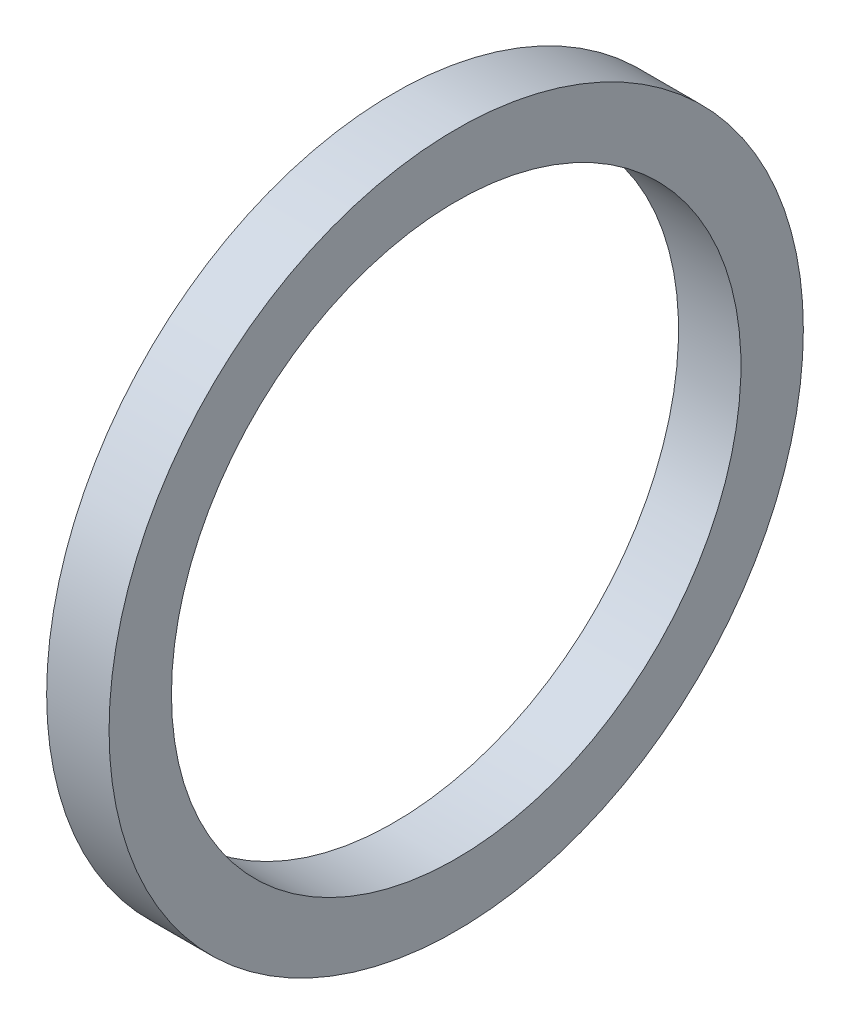
ISO-10303-21;
HEADER;
FILE_DESCRIPTION(('STEP AP214'),'2;1');
FILE_NAME('part.step','',(''),(''),'','','');
FILE_SCHEMA(('AUTOMOTIVE_DESIGN { 1 0 10303 214 1 1 1 1 }'));
ENDSEC;
DATA;
#1=APPLICATION_CONTEXT('core data for automotive mechanical design processes');
#2=APPLICATION_PROTOCOL_DEFINITION('international standard','automotive_design',2000,#1);
#3=PRODUCT_CONTEXT('',#1,'mechanical');
#4=PRODUCT('Part','Part','',(#3));
#5=PRODUCT_RELATED_PRODUCT_CATEGORY('part','',(#4));
#6=PRODUCT_DEFINITION_FORMATION('','',#4);
#7=PRODUCT_DEFINITION_CONTEXT('part definition',#1,'design');
#8=PRODUCT_DEFINITION('design','',#6,#7);
#9=PRODUCT_DEFINITION_SHAPE('','',#8);
#10=(LENGTH_UNIT() NAMED_UNIT(*) SI_UNIT(.MILLI.,.METRE.));
#11=(NAMED_UNIT(*) PLANE_ANGLE_UNIT() SI_UNIT($,.RADIAN.));
#12=(NAMED_UNIT(*) SI_UNIT($,.STERADIAN.) SOLID_ANGLE_UNIT());
#13=UNCERTAINTY_MEASURE_WITH_UNIT(LENGTH_MEASURE(1.E-05),#10,'distance_accuracy_value','');
#14=(GEOMETRIC_REPRESENTATION_CONTEXT(3) GLOBAL_UNCERTAINTY_ASSIGNED_CONTEXT((#13)) GLOBAL_UNIT_ASSIGNED_CONTEXT((#10,
#11,#12)) REPRESENTATION_CONTEXT('',''));
#15=CARTESIAN_POINT('',(0.,0.,0.));
#16=DIRECTION('',(0.,0.,1.));
#17=DIRECTION('',(1.,0.,0.));
#18=AXIS2_PLACEMENT_3D('',#15,#16,#17);
#19=CARTESIAN_POINT('',(0.,-9.271,0.));
#20=DIRECTION('',(-1.,0.,0.));
#21=DIRECTION('',(0.,0.,1.));
#22=AXIS2_PLACEMENT_3D('',#19,#20,#21);
#23=PLANE('',#22);
#24=CARTESIAN_POINT('',(0.,0.,0.));
#25=DIRECTION('',(-1.,0.,0.));
#26=DIRECTION('',(0.,0.,1.));
#27=AXIS2_PLACEMENT_3D('',#24,#25,#26);
#28=CIRCLE('',#27,11.303);
#29=CARTESIAN_POINT('',(0.,0.,11.303));
#30=VERTEX_POINT('',#29);
#31=EDGE_CURVE('E10',#30,#30,#28,.T.);
#32=ORIENTED_EDGE('',*,*,#31,.T.);
#33=EDGE_LOOP('',(#32));
#34=FACE_BOUND('',#33,.T.);
#35=CARTESIAN_POINT('',(0.,0.,0.));
#36=DIRECTION('',(-1.,0.,0.));
#37=DIRECTION('',(0.,0.,1.));
#38=AXIS2_PLACEMENT_3D('',#35,#36,#37);
#39=CIRCLE('',#38,9.271);
#40=CARTESIAN_POINT('',(0.,0.,9.271));
#41=VERTEX_POINT('',#40);
#42=EDGE_CURVE('E43',#41,#41,#39,.T.);
#43=ORIENTED_EDGE('',*,*,#42,.F.);
#44=EDGE_LOOP('',(#43));
#45=FACE_BOUND('',#44,.T.);
#46=ADVANCED_FACE('F29',(#34,#45),#23,.T.);
#47=CARTESIAN_POINT('',(-43.7165807560137,0.,0.));
#48=DIRECTION('',(-1.,0.,0.));
#49=DIRECTION('',(0.,0.,1.));
#50=AXIS2_PLACEMENT_3D('',#47,#48,#49);
#51=CYLINDRICAL_SURFACE('',#50,11.303);
#52=CARTESIAN_POINT('',(2.032,0.,0.));
#53=DIRECTION('',(-1.,0.,0.));
#54=DIRECTION('',(0.,0.,1.));
#55=AXIS2_PLACEMENT_3D('',#52,#53,#54);
#56=CIRCLE('',#55,11.303);
#57=CARTESIAN_POINT('',(2.032,0.,11.303));
#58=VERTEX_POINT('',#57);
#59=EDGE_CURVE('E35',#58,#58,#56,.T.);
#60=ORIENTED_EDGE('',*,*,#59,.T.);
#61=EDGE_LOOP('',(#60));
#62=FACE_BOUND('',#61,.T.);
#63=ORIENTED_EDGE('',*,*,#31,.F.);
#64=EDGE_LOOP('',(#63));
#65=FACE_BOUND('',#64,.T.);
#66=ADVANCED_FACE('F53',(#62,#65),#51,.T.);
#67=CARTESIAN_POINT('',(2.032,-9.271,0.));
#68=DIRECTION('',(1.,0.,0.));
#69=DIRECTION('',(0.,0.,-1.));
#70=AXIS2_PLACEMENT_3D('',#67,#68,#69);
#71=PLANE('',#70);
#72=CARTESIAN_POINT('',(2.032,0.,0.));
#73=DIRECTION('',(-1.,0.,0.));
#74=DIRECTION('',(0.,0.,1.));
#75=AXIS2_PLACEMENT_3D('',#72,#73,#74);
#76=CIRCLE('',#75,9.271);
#77=CARTESIAN_POINT('',(2.032,0.,9.271));
#78=VERTEX_POINT('',#77);
#79=EDGE_CURVE('E39',#78,#78,#76,.T.);
#80=ORIENTED_EDGE('',*,*,#79,.T.);
#81=EDGE_LOOP('',(#80));
#82=FACE_BOUND('',#81,.T.);
#83=ORIENTED_EDGE('',*,*,#59,.F.);
#84=EDGE_LOOP('',(#83));
#85=FACE_BOUND('',#84,.T.);
#86=ADVANCED_FACE('F57',(#82,#85),#71,.T.);
#87=CARTESIAN_POINT('',(-43.7165807560137,0.,0.));
#88=DIRECTION('',(-1.,0.,0.));
#89=DIRECTION('',(0.,0.,1.));
#90=AXIS2_PLACEMENT_3D('',#87,#88,#89);
#91=CYLINDRICAL_SURFACE('',#90,9.271);
#92=ORIENTED_EDGE('',*,*,#42,.T.);
#93=EDGE_LOOP('',(#92));
#94=FACE_BOUND('',#93,.T.);
#95=ORIENTED_EDGE('',*,*,#79,.F.);
#96=EDGE_LOOP('',(#95));
#97=FACE_BOUND('',#96,.T.);
#98=ADVANCED_FACE('F49',(#94,#97),#91,.F.);
#99=CLOSED_SHELL('',(#46,#66,#86,#98));
#100=MANIFOLD_SOLID_BREP('B2',#99);
#101=ADVANCED_BREP_SHAPE_REPRESENTATION('',(#18,#100),#14);
#102=SHAPE_DEFINITION_REPRESENTATION(#9,#101);
ENDSEC;
END-ISO-10303-21;
